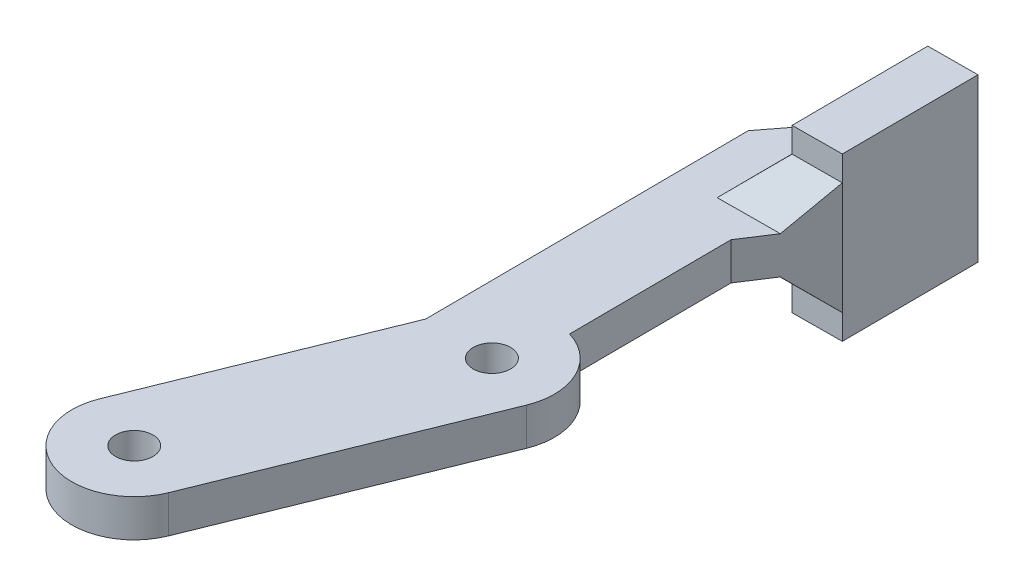
ISO-10303-21;
HEADER;
FILE_DESCRIPTION(('STEP AP214'),'2;1');
FILE_NAME('part.step','',(''),(''),'','','');
FILE_SCHEMA(('AUTOMOTIVE_DESIGN { 1 0 10303 214 1 1 1 1 }'));
ENDSEC;
DATA;
#1=APPLICATION_CONTEXT('core data for automotive mechanical design processes');
#2=APPLICATION_PROTOCOL_DEFINITION('international standard','automotive_design',2000,#1);
#3=PRODUCT_CONTEXT('',#1,'mechanical');
#4=PRODUCT('Part','Part','',(#3));
#5=PRODUCT_RELATED_PRODUCT_CATEGORY('part','',(#4));
#6=PRODUCT_DEFINITION_FORMATION('','',#4);
#7=PRODUCT_DEFINITION_CONTEXT('part definition',#1,'design');
#8=PRODUCT_DEFINITION('design','',#6,#7);
#9=PRODUCT_DEFINITION_SHAPE('','',#8);
#10=(LENGTH_UNIT() NAMED_UNIT(*) SI_UNIT(.MILLI.,.METRE.));
#11=(NAMED_UNIT(*) PLANE_ANGLE_UNIT() SI_UNIT($,.RADIAN.));
#12=(NAMED_UNIT(*) SI_UNIT($,.STERADIAN.) SOLID_ANGLE_UNIT());
#13=UNCERTAINTY_MEASURE_WITH_UNIT(LENGTH_MEASURE(1.E-05),#10,'distance_accuracy_value','');
#14=(GEOMETRIC_REPRESENTATION_CONTEXT(3) GLOBAL_UNCERTAINTY_ASSIGNED_CONTEXT((#13)) GLOBAL_UNIT_ASSIGNED_CONTEXT((#10,
#11,#12)) REPRESENTATION_CONTEXT('',''));
#15=CARTESIAN_POINT('',(0.,0.,0.));
#16=DIRECTION('',(0.,0.,1.));
#17=DIRECTION('',(1.,0.,0.));
#18=AXIS2_PLACEMENT_3D('',#15,#16,#17);
#19=CARTESIAN_POINT('',(-31.3872397273265,0.,12.6392763690197));
#20=DIRECTION('',(0.,1.,0.));
#21=DIRECTION('',(0.375044776060288,0.,-0.92700669682041));
#22=AXIS2_PLACEMENT_3D('',#19,#20,#21);
#23=CYLINDRICAL_SURFACE('',#22,1.5);
#24=CARTESIAN_POINT('',(-31.3872397273265,3.,12.6392763690197));
#25=DIRECTION('',(0.,-1.,0.));
#26=DIRECTION('',(0.375044776060288,0.,-0.92700669682041));
#27=AXIS2_PLACEMENT_3D('',#24,#25,#26);
#28=CIRCLE('',#27,1.5);
#29=CARTESIAN_POINT('',(-31.9498068914169,3.,14.0297864142503));
#30=VERTEX_POINT('',#29);
#31=EDGE_CURVE('E283',#30,#30,#28,.T.);
#32=ORIENTED_EDGE('',*,*,#31,.F.);
#33=DIRECTION('',(0.,-1.,0.));
#34=VECTOR('',#33,1.);
#35=CARTESIAN_POINT('',(-31.9498068914169,0.,14.0297864142503));
#36=LINE('',#35,#34);
#37=CARTESIAN_POINT('',(-31.9498068914169,0.,14.0297864142503));
#38=VERTEX_POINT('',#37);
#39=EDGE_CURVE('E296',#30,#38,#36,.T.);
#40=ORIENTED_EDGE('',*,*,#39,.T.);
#41=CARTESIAN_POINT('',(-31.3872397273265,0.,12.6392763690197));
#42=DIRECTION('',(0.,-1.,0.));
#43=DIRECTION('',(0.375044776060288,0.,-0.92700669682041));
#44=AXIS2_PLACEMENT_3D('',#41,#42,#43);
#45=CIRCLE('',#44,1.5);
#46=EDGE_CURVE('E300',#38,#38,#45,.T.);
#47=ORIENTED_EDGE('',*,*,#46,.T.);
#48=ORIENTED_EDGE('',*,*,#39,.F.);
#49=EDGE_LOOP('',(#32,#40,#47,#48));
#50=FACE_BOUND('',#49,.T.);
#51=ADVANCED_FACE('F45',(#50),#23,.F.);
#52=CARTESIAN_POINT('',(-23.1362546540001,0.,-7.75487096102932));
#53=DIRECTION('',(0.,1.,0.));
#54=DIRECTION('',(0.375044776060288,0.,-0.92700669682041));
#55=AXIS2_PLACEMENT_3D('',#52,#53,#54);
#56=CYLINDRICAL_SURFACE('',#55,1.5);
#57=CARTESIAN_POINT('',(-23.1362546540001,3.,-7.75487096102932));
#58=DIRECTION('',(0.,-1.,0.));
#59=DIRECTION('',(0.375044776060288,0.,-0.92700669682041));
#60=AXIS2_PLACEMENT_3D('',#57,#58,#59);
#61=CIRCLE('',#60,1.5);
#62=CARTESIAN_POINT('',(-23.6988218180906,3.,-6.3643609157987));
#63=VERTEX_POINT('',#62);
#64=EDGE_CURVE('E274',#63,#63,#61,.T.);
#65=ORIENTED_EDGE('',*,*,#64,.F.);
#66=DIRECTION('',(0.,-1.,0.));
#67=VECTOR('',#66,1.);
#68=CARTESIAN_POINT('',(-23.6988218180906,0.,-6.3643609157987));
#69=LINE('',#68,#67);
#70=CARTESIAN_POINT('',(-23.6988218180906,0.,-6.3643609157987));
#71=VERTEX_POINT('',#70);
#72=EDGE_CURVE('E303',#63,#71,#69,.T.);
#73=ORIENTED_EDGE('',*,*,#72,.T.);
#74=CARTESIAN_POINT('',(-23.1362546540001,0.,-7.75487096102932));
#75=DIRECTION('',(0.,-1.,0.));
#76=DIRECTION('',(0.375044776060288,0.,-0.92700669682041));
#77=AXIS2_PLACEMENT_3D('',#74,#75,#76);
#78=CIRCLE('',#77,1.5);
#79=EDGE_CURVE('E306',#71,#71,#78,.T.);
#80=ORIENTED_EDGE('',*,*,#79,.T.);
#81=ORIENTED_EDGE('',*,*,#72,.F.);
#82=EDGE_LOOP('',(#65,#73,#80,#81));
#83=FACE_BOUND('',#82,.T.);
#84=ADVANCED_FACE('F426',(#83),#56,.F.);
#85=CARTESIAN_POINT('',(-22.4694527490322,0.,-41.856975182389));
#86=DIRECTION('',(-0.793469040105591,0.,-0.60861061639928));
#87=DIRECTION('',(0.,-1.,0.));
#88=AXIS2_PLACEMENT_3D('',#85,#86,#87);
#89=PLANE('',#88);
#90=DIRECTION('',(0.60861061639928,0.,-0.793469040105591));
#91=VECTOR('',#90,1.);
#92=CARTESIAN_POINT('',(-28.6490392047294,0.,-33.8004109340342));
#93=LINE('',#92,#91);
#94=CARTESIAN_POINT('',(-28.6490392047294,0.,-33.8004109340342));
#95=VERTEX_POINT('',#94);
#96=CARTESIAN_POINT('',(-25.3076334762986,0.,-38.1567299408028));
#97=VERTEX_POINT('',#96);
#98=EDGE_CURVE('E280',#95,#97,#93,.T.);
#99=ORIENTED_EDGE('',*,*,#98,.F.);
#100=DIRECTION('',(0.,1.,0.));
#101=VECTOR('',#100,1.);
#102=CARTESIAN_POINT('',(-28.6490392047294,0.,-33.8004109340342));
#103=LINE('',#102,#101);
#104=CARTESIAN_POINT('',(-28.6490392047294,3.,-33.8004109340342));
#105=VERTEX_POINT('',#104);
#106=EDGE_CURVE('E234',#95,#105,#103,.T.);
#107=ORIENTED_EDGE('',*,*,#106,.T.);
#108=DIRECTION('',(-0.60861061639928,0.,0.793469040105591));
#109=VECTOR('',#108,1.);
#110=CARTESIAN_POINT('',(-28.6490392047294,3.,-33.8004109340342));
#111=LINE('',#110,#109);
#112=CARTESIAN_POINT('',(-25.3076334762987,3.,-38.1567299408027));
#113=VERTEX_POINT('',#112);
#114=EDGE_CURVE('E240',#113,#105,#111,.T.);
#115=ORIENTED_EDGE('',*,*,#114,.F.);
#116=DIRECTION('',(0.518862939394076,0.522667223898671,-0.676461545976854));
#117=VECTOR('',#116,1.);
#118=CARTESIAN_POINT('',(-34.2394605458331,-5.99731490599091,-26.5119638780906));
#119=LINE('',#118,#117);
#120=CARTESIAN_POINT('',(-22.4694527490322,5.85899016679708,-41.856975182389));
#121=VERTEX_POINT('',#120);
#122=EDGE_CURVE('E326',#113,#121,#119,.T.);
#123=ORIENTED_EDGE('',*,*,#122,.T.);
#124=DIRECTION('',(0.,1.,0.));
#125=VECTOR('',#124,1.);
#126=CARTESIAN_POINT('',(-22.4694527490322,0.,-41.856975182389));
#127=LINE('',#126,#125);
#128=CARTESIAN_POINT('',(-22.4694527490322,-2.85899016679709,-41.856975182389));
#129=VERTEX_POINT('',#128);
#130=EDGE_CURVE('E232',#129,#121,#127,.T.);
#131=ORIENTED_EDGE('',*,*,#130,.F.);
#132=DIRECTION('',(0.518862939394073,-0.52266722389868,-0.67646154597685));
#133=VECTOR('',#132,1.);
#134=CARTESIAN_POINT('',(-37.0646653622775,11.8432340230524,-22.8286358299069));
#135=LINE('',#134,#133);
#136=EDGE_CURVE('E337',#129,#97,#135,.F.);
#137=ORIENTED_EDGE('',*,*,#136,.T.);
#138=EDGE_LOOP('',(#99,#107,#115,#123,#131,#137));
#139=FACE_BOUND('',#138,.T.);
#140=ADVANCED_FACE('F407',(#139),#89,.T.);
#141=CARTESIAN_POINT('',(-18.3285086844811,0.,-41.8803138400729));
#142=DIRECTION('',(-0.00563598219370531,0.,-0.999984117726233));
#143=DIRECTION('',(0.,-1.,0.));
#144=AXIS2_PLACEMENT_3D('',#141,#142,#143);
#145=PLANE('',#144);
#146=DIRECTION('',(0.,1.,0.));
#147=VECTOR('',#146,1.);
#148=CARTESIAN_POINT('',(-22.328445155386,8.,-41.8577699112981));
#149=LINE('',#148,#147);
#150=CARTESIAN_POINT('',(-22.328445155386,-5.,-41.8577699112981));
#151=VERTEX_POINT('',#150);
#152=CARTESIAN_POINT('',(-22.328445155386,-3.00000000000001,-41.8577699112981));
#153=VERTEX_POINT('',#152);
#154=EDGE_CURVE('E211',#151,#153,#149,.T.);
#155=ORIENTED_EDGE('',*,*,#154,.T.);
#156=DIRECTION('',(0.707095550723062,-0.707106781186551,-0.00398524122781564));
#157=VECTOR('',#156,1.);
#158=CARTESIAN_POINT('',(-22.328445155386,-3.00000000000001,-41.8577699112981));
#159=LINE('',#158,#157);
#160=EDGE_CURVE('E334',#153,#129,#159,.F.);
#161=ORIENTED_EDGE('',*,*,#160,.T.);
#162=ORIENTED_EDGE('',*,*,#130,.T.);
#163=DIRECTION('',(0.70709555072307,0.707106781186544,-0.00398524122781568));
#164=VECTOR('',#163,1.);
#165=CARTESIAN_POINT('',(-25.3283975085647,3.,-41.8408619647169));
#166=LINE('',#165,#164);
#167=CARTESIAN_POINT('',(-22.328445155386,5.99999999999999,-41.8577699112981));
#168=VERTEX_POINT('',#167);
#169=EDGE_CURVE('E329',#121,#168,#166,.T.);
#170=ORIENTED_EDGE('',*,*,#169,.T.);
#171=CARTESIAN_POINT('',(-22.328445155386,8.,-41.8577699112981));
#172=VERTEX_POINT('',#171);
#173=EDGE_CURVE('E212',#168,#172,#149,.T.);
#174=ORIENTED_EDGE('',*,*,#173,.T.);
#175=DIRECTION('',(0.999984117726233,0.,-0.00563598219370531));
#176=VECTOR('',#175,1.);
#177=CARTESIAN_POINT('',(-22.328445155386,8.,-41.8577699112981));
#178=LINE('',#177,#176);
#179=CARTESIAN_POINT('',(-18.3285086844811,8.,-41.8803138400729));
#180=VERTEX_POINT('',#179);
#181=EDGE_CURVE('E228',#172,#180,#178,.T.);
#182=ORIENTED_EDGE('',*,*,#181,.T.);
#183=DIRECTION('',(0.,1.,0.));
#184=VECTOR('',#183,1.);
#185=CARTESIAN_POINT('',(-18.3285086844811,0.,-41.8803138400729));
#186=LINE('',#185,#184);
#187=CARTESIAN_POINT('',(-18.3285086844811,-5.,-41.8803138400729));
#188=VERTEX_POINT('',#187);
#189=EDGE_CURVE('E235',#188,#180,#186,.T.);
#190=ORIENTED_EDGE('',*,*,#189,.F.);
#191=DIRECTION('',(0.999984117726233,0.,-0.00563598219370531));
#192=VECTOR('',#191,1.);
#193=CARTESIAN_POINT('',(-22.328445155386,-5.,-41.8577699112981));
#194=LINE('',#193,#192);
#195=EDGE_CURVE('E205',#151,#188,#194,.T.);
#196=ORIENTED_EDGE('',*,*,#195,.F.);
#197=EDGE_LOOP('',(#155,#161,#162,#170,#174,#182,#190,#196));
#198=FACE_BOUND('',#197,.T.);
#199=ADVANCED_FACE('F363',(#198),#145,.T.);
#200=CARTESIAN_POINT('',(-18.2669129599048,0.,-30.9514740781325));
#201=DIRECTION('',(0.999984117726233,0.,-0.00563598219370531));
#202=DIRECTION('',(0.,-1.,0.));
#203=AXIS2_PLACEMENT_3D('',#200,#201,#202);
#204=PLANE('',#203);
#205=DIRECTION('',(0.,1.,0.));
#206=VECTOR('',#205,1.);
#207=CARTESIAN_POINT('',(-18.2669129599048,0.,-30.9514740781325));
#208=LINE('',#207,#206);
#209=CARTESIAN_POINT('',(-18.2669129599048,-3.,-30.9514740781325));
#210=VERTEX_POINT('',#209);
#211=CARTESIAN_POINT('',(-18.2669129599048,6.00000000000001,-30.9514740781325));
#212=VERTEX_POINT('',#211);
#213=EDGE_CURVE('E61',#210,#212,#208,.T.);
#214=ORIENTED_EDGE('',*,*,#213,.F.);
#215=DIRECTION('',(0.,-1.,0.));
#216=VECTOR('',#215,1.);
#217=CARTESIAN_POINT('',(-18.2669129599048,8.,-30.9514740781325));
#218=LINE('',#217,#216);
#219=CARTESIAN_POINT('',(-18.2669129599048,-5.,-30.9514740781325));
#220=VERTEX_POINT('',#219);
#221=EDGE_CURVE('E221',#210,#220,#218,.T.);
#222=ORIENTED_EDGE('',*,*,#221,.T.);
#223=DIRECTION('',(-0.00563598219370546,0.,-0.999984117726233));
#224=VECTOR('',#223,1.);
#225=CARTESIAN_POINT('',(-18.2669129599048,-5.,-30.9514740781325));
#226=LINE('',#225,#224);
#227=EDGE_CURVE('E204',#220,#188,#226,.T.);
#228=ORIENTED_EDGE('',*,*,#227,.T.);
#229=ORIENTED_EDGE('',*,*,#189,.T.);
#230=DIRECTION('',(0.00563598219370546,0.,0.999984117726233));
#231=VECTOR('',#230,1.);
#232=CARTESIAN_POINT('',(-18.2669129599048,8.,-30.9514740781325));
#233=LINE('',#232,#231);
#234=CARTESIAN_POINT('',(-18.2669129599048,8.,-30.9514740781325));
#235=VERTEX_POINT('',#234);
#236=EDGE_CURVE('E196',#180,#235,#233,.T.);
#237=ORIENTED_EDGE('',*,*,#236,.T.);
#238=EDGE_CURVE('E219',#235,#212,#218,.T.);
#239=ORIENTED_EDGE('',*,*,#238,.T.);
#240=EDGE_LOOP('',(#214,#222,#228,#229,#237,#239));
#241=FACE_BOUND('',#240,.T.);
#242=ADVANCED_FACE('F364',(#241),#204,.T.);
#243=CARTESIAN_POINT('',(-21.7766740850845,0.,-25.5449615221264));
#244=DIRECTION('',(0.838760494799222,0.,0.544500534769402));
#245=DIRECTION('',(-0.544500534769402,0.,0.838760494799222));
#246=AXIS2_PLACEMENT_3D('',#243,#244,#245);
#247=PLANE('',#246);
#248=DIRECTION('',(0.544500534769402,0.,-0.838760494799222));
#249=VECTOR('',#248,1.);
#250=CARTESIAN_POINT('',(-21.7766740850845,0.,-25.5449615221264));
#251=LINE('',#250,#249);
#252=CARTESIAN_POINT('',(-21.7766740850845,0.,-25.5449615221264));
#253=VERTEX_POINT('',#252);
#254=CARTESIAN_POINT('',(-20.2216142507366,0.,-27.9404095939129));
#255=VERTEX_POINT('',#254);
#256=EDGE_CURVE('E256',#253,#255,#251,.T.);
#257=ORIENTED_EDGE('',*,*,#256,.T.);
#258=DIRECTION('',(0.417814631992256,-0.641245750363926,-0.643610768192532));
#259=VECTOR('',#258,1.);
#260=CARTESIAN_POINT('',(-21.3437182836396,1.72216190499193,-26.2118960778471));
#261=LINE('',#260,#259);
#262=EDGE_CURVE('E54',#255,#210,#261,.T.);
#263=ORIENTED_EDGE('',*,*,#262,.T.);
#264=ORIENTED_EDGE('',*,*,#213,.T.);
#265=DIRECTION('',(0.417814631992252,0.641245750363935,-0.643610768192526));
#266=VECTOR('',#265,1.);
#267=CARTESIAN_POINT('',(-18.9712404243197,4.91902542697678,-29.8665126964076));
#268=LINE('',#267,#266);
#269=CARTESIAN_POINT('',(-20.2216142507365,3.,-27.9404095939129));
#270=VERTEX_POINT('',#269);
#271=EDGE_CURVE('E345',#212,#270,#268,.F.);
#272=ORIENTED_EDGE('',*,*,#271,.T.);
#273=DIRECTION('',(0.544500534769402,0.,-0.838760494799222));
#274=VECTOR('',#273,1.);
#275=CARTESIAN_POINT('',(-21.7766740850845,3.,-25.5449615221264));
#276=LINE('',#275,#274);
#277=CARTESIAN_POINT('',(-21.7766740850845,3.,-25.5449615221264));
#278=VERTEX_POINT('',#277);
#279=EDGE_CURVE('E236',#278,#270,#276,.T.);
#280=ORIENTED_EDGE('',*,*,#279,.F.);
#281=DIRECTION('',(0.,1.,0.));
#282=VECTOR('',#281,1.);
#283=CARTESIAN_POINT('',(-21.7766740850845,0.,-25.5449615221264));
#284=LINE('',#283,#282);
#285=EDGE_CURVE('E266',#253,#278,#284,.T.);
#286=ORIENTED_EDGE('',*,*,#285,.F.);
#287=EDGE_LOOP('',(#257,#263,#264,#272,#280,#286));
#288=FACE_BOUND('',#287,.T.);
#289=ADVANCED_FACE('F353',(#288),#247,.T.);
#290=CARTESIAN_POINT('',(-21.7034063165663,0.,-12.5451679916855));
#291=DIRECTION('',(0.999984117726233,0.,-0.00563598219370576));
#292=DIRECTION('',(0.,-1.,0.));
#293=AXIS2_PLACEMENT_3D('',#290,#291,#292);
#294=PLANE('',#293);
#295=DIRECTION('',(0.00563598219370531,0.,0.999984117726233));
#296=VECTOR('',#295,1.);
#297=CARTESIAN_POINT('',(-21.7766740850845,0.,-25.5449615221264));
#298=LINE('',#297,#296);
#299=CARTESIAN_POINT('',(-21.7034063165663,0.,-12.5451679916855));
#300=VERTEX_POINT('',#299);
#301=EDGE_CURVE('E227',#253,#300,#298,.T.);
#302=ORIENTED_EDGE('',*,*,#301,.F.);
#303=ORIENTED_EDGE('',*,*,#285,.T.);
#304=DIRECTION('',(-0.00563598219370531,0.,-0.999984117726233));
#305=VECTOR('',#304,1.);
#306=CARTESIAN_POINT('',(-21.7766740850845,3.,-25.5449615221264));
#307=LINE('',#306,#305);
#308=CARTESIAN_POINT('',(-21.7034063165663,3.,-12.5451679916855));
#309=VERTEX_POINT('',#308);
#310=EDGE_CURVE('E239',#309,#278,#307,.T.);
#311=ORIENTED_EDGE('',*,*,#310,.F.);
#312=DIRECTION('',(0.,1.,0.));
#313=VECTOR('',#312,1.);
#314=CARTESIAN_POINT('',(-21.7034063165663,0.,-12.5451679916855));
#315=LINE('',#314,#313);
#316=EDGE_CURVE('E264',#300,#309,#315,.T.);
#317=ORIENTED_EDGE('',*,*,#316,.F.);
#318=EDGE_LOOP('',(#302,#303,#311,#317));
#319=FACE_BOUND('',#318,.T.);
#320=ADVANCED_FACE('F386',(#319),#294,.T.);
#321=CARTESIAN_POINT('',(-23.1362546540001,0.,-7.75487096102932));
#322=DIRECTION('',(0.,1.,0.));
#323=DIRECTION('',(0.92700669682041,0.,0.375044776060288));
#324=AXIS2_PLACEMENT_3D('',#321,#322,#323);
#325=CYLINDRICAL_SURFACE('',#324,5.);
#326=CARTESIAN_POINT('',(-23.1362546540001,0.,-7.75487096102932));
#327=DIRECTION('',(0.,1.,0.));
#328=DIRECTION('',(0.92700669682041,0.,0.375044776060288));
#329=AXIS2_PLACEMENT_3D('',#326,#327,#328);
#330=CIRCLE('',#329,5.);
#331=CARTESIAN_POINT('',(-18.5012211698981,0.,-5.87964708072788));
#332=VERTEX_POINT('',#331);
#333=EDGE_CURVE('E269',#332,#300,#330,.T.);
#334=ORIENTED_EDGE('',*,*,#333,.T.);
#335=ORIENTED_EDGE('',*,*,#316,.T.);
#336=CARTESIAN_POINT('',(-23.1362546540001,3.,-7.75487096102932));
#337=DIRECTION('',(0.,1.,0.));
#338=DIRECTION('',(0.92700669682041,0.,0.375044776060288));
#339=AXIS2_PLACEMENT_3D('',#336,#337,#338);
#340=CIRCLE('',#339,5.);
#341=CARTESIAN_POINT('',(-18.5012211698981,3.,-5.87964708072788));
#342=VERTEX_POINT('',#341);
#343=EDGE_CURVE('E245',#342,#309,#340,.T.);
#344=ORIENTED_EDGE('',*,*,#343,.F.);
#345=DIRECTION('',(0.,1.,0.));
#346=VECTOR('',#345,1.);
#347=CARTESIAN_POINT('',(-18.5012211698981,0.,-5.87964708072788));
#348=LINE('',#347,#346);
#349=EDGE_CURVE('E246',#332,#342,#348,.T.);
#350=ORIENTED_EDGE('',*,*,#349,.F.);
#351=EDGE_LOOP('',(#334,#335,#344,#350));
#352=FACE_BOUND('',#351,.T.);
#353=ADVANCED_FACE('F388',(#352),#325,.T.);
#354=CARTESIAN_POINT('',(-26.7522062432244,0.,14.5145002493212));
#355=DIRECTION('',(0.92700669682041,0.,0.375044776060288));
#356=DIRECTION('',(0.,-1.,0.));
#357=AXIS2_PLACEMENT_3D('',#354,#355,#356);
#358=PLANE('',#357);
#359=DIRECTION('',(0.375044776060288,0.,-0.92700669682041));
#360=VECTOR('',#359,1.);
#361=CARTESIAN_POINT('',(-26.7522062432244,0.,14.5145002493212));
#362=LINE('',#361,#360);
#363=CARTESIAN_POINT('',(-26.7522062432244,0.,14.5145002493212));
#364=VERTEX_POINT('',#363);
#365=EDGE_CURVE('E249',#364,#332,#362,.T.);
#366=ORIENTED_EDGE('',*,*,#365,.T.);
#367=ORIENTED_EDGE('',*,*,#349,.T.);
#368=DIRECTION('',(0.375044776060288,0.,-0.92700669682041));
#369=VECTOR('',#368,1.);
#370=CARTESIAN_POINT('',(-26.7522062432244,3.,14.5145002493212));
#371=LINE('',#370,#369);
#372=CARTESIAN_POINT('',(-26.7522062432244,3.,14.5145002493212));
#373=VERTEX_POINT('',#372);
#374=EDGE_CURVE('E241',#373,#342,#371,.T.);
#375=ORIENTED_EDGE('',*,*,#374,.F.);
#376=DIRECTION('',(0.,1.,0.));
#377=VECTOR('',#376,1.);
#378=CARTESIAN_POINT('',(-26.7522062432244,0.,14.5145002493212));
#379=LINE('',#378,#377);
#380=EDGE_CURVE('E287',#364,#373,#379,.T.);
#381=ORIENTED_EDGE('',*,*,#380,.F.);
#382=EDGE_LOOP('',(#366,#367,#375,#381));
#383=FACE_BOUND('',#382,.T.);
#384=ADVANCED_FACE('F395',(#383),#358,.T.);
#385=CARTESIAN_POINT('',(-31.3872397273265,0.,12.6392763690197));
#386=DIRECTION('',(0.,1.,0.));
#387=DIRECTION('',(-0.92700669682041,0.,-0.375044776060288));
#388=AXIS2_PLACEMENT_3D('',#385,#386,#387);
#389=CYLINDRICAL_SURFACE('',#388,5.);
#390=CARTESIAN_POINT('',(-31.3872397273265,0.,12.6392763690197));
#391=DIRECTION('',(0.,1.,0.));
#392=DIRECTION('',(-0.92700669682041,0.,-0.375044776060288));
#393=AXIS2_PLACEMENT_3D('',#390,#391,#392);
#394=CIRCLE('',#393,5.);
#395=CARTESIAN_POINT('',(-36.0222732114285,0.,10.7640524887183));
#396=VERTEX_POINT('',#395);
#397=EDGE_CURVE('E250',#396,#364,#394,.T.);
#398=ORIENTED_EDGE('',*,*,#397,.T.);
#399=ORIENTED_EDGE('',*,*,#380,.T.);
#400=CARTESIAN_POINT('',(-31.3872397273265,3.,12.6392763690197));
#401=DIRECTION('',(0.,1.,0.));
#402=DIRECTION('',(-0.92700669682041,0.,-0.375044776060288));
#403=AXIS2_PLACEMENT_3D('',#400,#401,#402);
#404=CIRCLE('',#403,5.);
#405=CARTESIAN_POINT('',(-36.0222732114285,3.,10.7640524887183));
#406=VERTEX_POINT('',#405);
#407=EDGE_CURVE('E244',#406,#373,#404,.T.);
#408=ORIENTED_EDGE('',*,*,#407,.F.);
#409=DIRECTION('',(0.,1.,0.));
#410=VECTOR('',#409,1.);
#411=CARTESIAN_POINT('',(-36.0222732114285,0.,10.7640524887183));
#412=LINE('',#411,#410);
#413=EDGE_CURVE('E254',#396,#406,#412,.T.);
#414=ORIENTED_EDGE('',*,*,#413,.F.);
#415=EDGE_LOOP('',(#398,#399,#408,#414));
#416=FACE_BOUND('',#415,.T.);
#417=ADVANCED_FACE('F397',(#416),#389,.T.);
#418=CARTESIAN_POINT('',(-28.5026254514198,0.,-7.82243178253096));
#419=DIRECTION('',(-0.92700669682041,0.,-0.375044776060288));
#420=DIRECTION('',(0.375044776060288,0.,-0.92700669682041));
#421=AXIS2_PLACEMENT_3D('',#418,#419,#420);
#422=PLANE('',#421);
#423=DIRECTION('',(-0.375044776060288,0.,0.92700669682041));
#424=VECTOR('',#423,1.);
#425=CARTESIAN_POINT('',(-27.7712881381022,0.,-9.63009484133076));
#426=LINE('',#425,#424);
#427=CARTESIAN_POINT('',(-28.5026254514198,0.,-7.82243178253096));
#428=VERTEX_POINT('',#427);
#429=EDGE_CURVE('E290',#428,#396,#426,.T.);
#430=ORIENTED_EDGE('',*,*,#429,.T.);
#431=ORIENTED_EDGE('',*,*,#413,.T.);
#432=DIRECTION('',(-0.375044776060288,0.,0.92700669682041));
#433=VECTOR('',#432,1.);
#434=CARTESIAN_POINT('',(-27.7712881381022,3.,-9.63009484133076));
#435=LINE('',#434,#433);
#436=CARTESIAN_POINT('',(-28.5026254514198,3.,-7.82243178253096));
#437=VERTEX_POINT('',#436);
#438=EDGE_CURVE('E272',#437,#406,#435,.T.);
#439=ORIENTED_EDGE('',*,*,#438,.F.);
#440=DIRECTION('',(0.,1.,0.));
#441=VECTOR('',#440,1.);
#442=CARTESIAN_POINT('',(-28.5026254514198,0.,-7.82243178253096));
#443=LINE('',#442,#441);
#444=EDGE_CURVE('E255',#428,#437,#443,.T.);
#445=ORIENTED_EDGE('',*,*,#444,.F.);
#446=EDGE_LOOP('',(#430,#431,#439,#445));
#447=FACE_BOUND('',#446,.T.);
#448=ADVANCED_FACE('F400',(#447),#422,.T.);
#449=CARTESIAN_POINT('',(-28.6490392047294,0.,-33.8004109340342));
#450=DIRECTION('',(-0.999984117726233,0.,0.00563598219370531));
#451=DIRECTION('',(0.,1.,0.));
#452=AXIS2_PLACEMENT_3D('',#449,#450,#451);
#453=PLANE('',#452);
#454=DIRECTION('',(0.00563598219370531,0.,0.999984117726233));
#455=VECTOR('',#454,1.);
#456=CARTESIAN_POINT('',(-28.6942488460058,0.,-41.8218917852229));
#457=LINE('',#456,#455);
#458=EDGE_CURVE('E251',#95,#428,#457,.T.);
#459=ORIENTED_EDGE('',*,*,#458,.T.);
#460=ORIENTED_EDGE('',*,*,#444,.T.);
#461=DIRECTION('',(0.00563598219370531,0.,0.999984117726233));
#462=VECTOR('',#461,1.);
#463=CARTESIAN_POINT('',(-28.6942488460058,3.,-41.8218917852229));
#464=LINE('',#463,#462);
#465=EDGE_CURVE('E261',#105,#437,#464,.T.);
#466=ORIENTED_EDGE('',*,*,#465,.F.);
#467=ORIENTED_EDGE('',*,*,#106,.F.);
#468=EDGE_LOOP('',(#459,#460,#466,#467));
#469=FACE_BOUND('',#468,.T.);
#470=ADVANCED_FACE('F403',(#469),#453,.T.);
#471=CARTESIAN_POINT('',(-26.5078331007745,3.,-12.5912005631586));
#472=DIRECTION('',(0.,1.,0.));
#473=DIRECTION('',(0.375044776060288,0.,-0.92700669682041));
#474=AXIS2_PLACEMENT_3D('',#471,#472,#473);
#475=PLANE('',#474);
#476=ORIENTED_EDGE('',*,*,#279,.T.);
#477=DIRECTION('',(-0.999984117726233,0.,0.00563598219370531));
#478=VECTOR('',#477,1.);
#479=CARTESIAN_POINT('',(-25.2498938374073,3.,-27.9120698495979));
#480=LINE('',#479,#478);
#481=CARTESIAN_POINT('',(-25.2498938374073,3.,-27.9120698495979));
#482=VERTEX_POINT('',#481);
#483=EDGE_CURVE('E342',#270,#482,#480,.T.);
#484=ORIENTED_EDGE('',*,*,#483,.T.);
#485=DIRECTION('',(-0.00563598219370546,0.,-0.999984117726233));
#486=VECTOR('',#485,1.);
#487=CARTESIAN_POINT('',(-25.163587019876,3.,-12.5987768304628));
#488=LINE('',#487,#486);
#489=EDGE_CURVE('E299',#482,#113,#488,.T.);
#490=ORIENTED_EDGE('',*,*,#489,.T.);
#491=ORIENTED_EDGE('',*,*,#114,.T.);
#492=ORIENTED_EDGE('',*,*,#465,.T.);
#493=ORIENTED_EDGE('',*,*,#438,.T.);
#494=ORIENTED_EDGE('',*,*,#407,.T.);
#495=ORIENTED_EDGE('',*,*,#374,.T.);
#496=ORIENTED_EDGE('',*,*,#343,.T.);
#497=ORIENTED_EDGE('',*,*,#310,.T.);
#498=EDGE_LOOP('',(#476,#484,#490,#491,#492,#493,#494,#495,#496,#497));
#499=FACE_BOUND('',#498,.T.);
#500=ORIENTED_EDGE('',*,*,#64,.T.);
#501=EDGE_LOOP('',(#500));
#502=FACE_BOUND('',#501,.T.);
#503=ORIENTED_EDGE('',*,*,#31,.T.);
#504=EDGE_LOOP('',(#503));
#505=FACE_BOUND('',#504,.T.);
#506=ADVANCED_FACE('F381',(#499,#502,#505),#475,.T.);
#507=CARTESIAN_POINT('',(-26.5078331007745,0.,-12.5912005631586));
#508=DIRECTION('',(0.,1.,0.));
#509=DIRECTION('',(0.375044776060288,0.,-0.92700669682041));
#510=AXIS2_PLACEMENT_3D('',#507,#508,#509);
#511=PLANE('',#510);
#512=DIRECTION('',(0.00563598219370546,0.,0.999984117726233));
#513=VECTOR('',#512,1.);
#514=CARTESIAN_POINT('',(-25.2668017839884,0.,-30.9120222027766));
#515=LINE('',#514,#513);
#516=CARTESIAN_POINT('',(-25.2498938374073,0.,-27.9120698495978));
#517=VERTEX_POINT('',#516);
#518=EDGE_CURVE('E69',#97,#517,#515,.T.);
#519=ORIENTED_EDGE('',*,*,#518,.T.);
#520=DIRECTION('',(0.999984117726233,0.,-0.00563598219370531));
#521=VECTOR('',#520,1.);
#522=CARTESIAN_POINT('',(-26.5941399183059,0.,-27.9044935822936));
#523=LINE('',#522,#521);
#524=EDGE_CURVE('E349',#517,#255,#523,.T.);
#525=ORIENTED_EDGE('',*,*,#524,.T.);
#526=ORIENTED_EDGE('',*,*,#256,.F.);
#527=ORIENTED_EDGE('',*,*,#301,.T.);
#528=ORIENTED_EDGE('',*,*,#333,.F.);
#529=ORIENTED_EDGE('',*,*,#365,.F.);
#530=ORIENTED_EDGE('',*,*,#397,.F.);
#531=ORIENTED_EDGE('',*,*,#429,.F.);
#532=ORIENTED_EDGE('',*,*,#458,.F.);
#533=ORIENTED_EDGE('',*,*,#98,.T.);
#534=EDGE_LOOP('',(#519,#525,#526,#527,#528,#529,#530,#531,#532,#533));
#535=FACE_BOUND('',#534,.T.);
#536=ORIENTED_EDGE('',*,*,#79,.F.);
#537=EDGE_LOOP('',(#536));
#538=FACE_BOUND('',#537,.T.);
#539=ORIENTED_EDGE('',*,*,#46,.F.);
#540=EDGE_LOOP('',(#539));
#541=FACE_BOUND('',#540,.T.);
#542=ADVANCED_FACE('F391',(#535,#538,#541),#511,.F.);
#543=CARTESIAN_POINT('',(-22.2668494308097,-5.,-30.9289301493577));
#544=DIRECTION('',(0.,-1.,0.));
#545=DIRECTION('',(0.,0.,-1.));
#546=AXIS2_PLACEMENT_3D('',#543,#544,#545);
#547=PLANE('',#546);
#548=ORIENTED_EDGE('',*,*,#227,.F.);
#549=DIRECTION('',(0.999984117726233,0.,-0.00563598219370531));
#550=VECTOR('',#549,1.);
#551=CARTESIAN_POINT('',(-22.2668494308097,-5.,-30.9289301493577));
#552=LINE('',#551,#550);
#553=CARTESIAN_POINT('',(-22.2668494308097,-5.,-30.9289301493577));
#554=VERTEX_POINT('',#553);
#555=EDGE_CURVE('E187',#554,#220,#552,.T.);
#556=ORIENTED_EDGE('',*,*,#555,.F.);
#557=DIRECTION('',(-0.00563598219370546,0.,-0.999984117726233));
#558=VECTOR('',#557,1.);
#559=CARTESIAN_POINT('',(-22.2668494308097,-5.,-30.9289301493577));
#560=LINE('',#559,#558);
#561=EDGE_CURVE('E202',#554,#151,#560,.T.);
#562=ORIENTED_EDGE('',*,*,#561,.T.);
#563=ORIENTED_EDGE('',*,*,#195,.T.);
#564=EDGE_LOOP('',(#548,#556,#562,#563));
#565=FACE_BOUND('',#564,.T.);
#566=ADVANCED_FACE('F200',(#565),#547,.T.);
#567=CARTESIAN_POINT('',(-22.0918300089541,0.,0.124511138076814));
#568=DIRECTION('',(0.999984117726233,0.,-0.00563598219370546));
#569=DIRECTION('',(-0.00563598219370546,0.,-0.999984117726233));
#570=AXIS2_PLACEMENT_3D('',#567,#568,#569);
#571=PLANE('',#570);
#572=DIRECTION('',(0.,-1.,0.));
#573=VECTOR('',#572,1.);
#574=CARTESIAN_POINT('',(-22.2668494308097,8.,-30.9289301493577));
#575=LINE('',#574,#573);
#576=CARTESIAN_POINT('',(-22.2668494308097,-3.00000000000001,-30.9289301493577));
#577=VERTEX_POINT('',#576);
#578=EDGE_CURVE('E184',#577,#554,#575,.T.);
#579=ORIENTED_EDGE('',*,*,#578,.F.);
#580=DIRECTION('',(-0.00563598219370546,0.,-0.999984117726233));
#581=VECTOR('',#580,1.);
#582=CARTESIAN_POINT('',(-22.328445155386,-3.00000000000001,-41.8577699112981));
#583=LINE('',#582,#581);
#584=EDGE_CURVE('E331',#577,#153,#583,.T.);
#585=ORIENTED_EDGE('',*,*,#584,.T.);
#586=ORIENTED_EDGE('',*,*,#154,.F.);
#587=ORIENTED_EDGE('',*,*,#561,.F.);
#588=EDGE_LOOP('',(#579,#585,#586,#587));
#589=FACE_BOUND('',#588,.T.);
#590=ADVANCED_FACE('F209',(#589),#571,.F.);
#591=CARTESIAN_POINT('',(-22.2668494308097,8.,-30.9289301493577));
#592=DIRECTION('',(0.00563598219370531,0.,0.999984117726233));
#593=DIRECTION('',(0.999984117726233,0.,-0.00563598219370531));
#594=AXIS2_PLACEMENT_3D('',#591,#592,#593);
#595=PLANE('',#594);
#596=ORIENTED_EDGE('',*,*,#221,.F.);
#597=DIRECTION('',(-0.999984117726233,0.,0.00563598219370531));
#598=VECTOR('',#597,1.);
#599=CARTESIAN_POINT('',(-22.2668494308097,-3.,-30.9289301493577));
#600=LINE('',#599,#598);
#601=EDGE_CURVE('E190',#210,#577,#600,.T.);
#602=ORIENTED_EDGE('',*,*,#601,.T.);
#603=ORIENTED_EDGE('',*,*,#578,.T.);
#604=ORIENTED_EDGE('',*,*,#555,.T.);
#605=EDGE_LOOP('',(#596,#602,#603,#604));
#606=FACE_BOUND('',#605,.T.);
#607=ADVANCED_FACE('F186',(#606),#595,.T.);
#608=CARTESIAN_POINT('',(-22.2668494308097,8.,-30.9289301493577));
#609=VERTEX_POINT('',#608);
#610=CARTESIAN_POINT('',(-22.2668494308097,5.99999999999999,-30.9289301493577));
#611=VERTEX_POINT('',#610);
#612=EDGE_CURVE('E195',#609,#611,#575,.T.);
#613=ORIENTED_EDGE('',*,*,#612,.T.);
#614=DIRECTION('',(0.999984117726233,0.,-0.00563598219370531));
#615=VECTOR('',#614,1.);
#616=CARTESIAN_POINT('',(-18.2669129599048,6.00000000000001,-30.9514740781325));
#617=LINE('',#616,#615);
#618=EDGE_CURVE('E339',#611,#212,#617,.T.);
#619=ORIENTED_EDGE('',*,*,#618,.T.);
#620=ORIENTED_EDGE('',*,*,#238,.F.);
#621=DIRECTION('',(0.999984117726233,0.,-0.00563598219370531));
#622=VECTOR('',#621,1.);
#623=CARTESIAN_POINT('',(-22.2668494308097,8.,-30.9289301493577));
#624=LINE('',#623,#622);
#625=EDGE_CURVE('E225',#609,#235,#624,.T.);
#626=ORIENTED_EDGE('',*,*,#625,.F.);
#627=EDGE_LOOP('',(#613,#619,#620,#626));
#628=FACE_BOUND('',#627,.T.);
#629=ADVANCED_FACE('F374',(#628),#595,.T.);
#630=CARTESIAN_POINT('',(-22.2668494308097,8.,-30.9289301493577));
#631=DIRECTION('',(0.,1.,0.));
#632=DIRECTION('',(0.,0.,1.));
#633=AXIS2_PLACEMENT_3D('',#630,#631,#632);
#634=PLANE('',#633);
#635=ORIENTED_EDGE('',*,*,#236,.F.);
#636=ORIENTED_EDGE('',*,*,#181,.F.);
#637=DIRECTION('',(0.00563598219370546,0.,0.999984117726233));
#638=VECTOR('',#637,1.);
#639=CARTESIAN_POINT('',(-22.2668494308097,8.,-30.9289301493577));
#640=LINE('',#639,#638);
#641=EDGE_CURVE('E206',#172,#609,#640,.T.);
#642=ORIENTED_EDGE('',*,*,#641,.T.);
#643=ORIENTED_EDGE('',*,*,#625,.T.);
#644=EDGE_LOOP('',(#635,#636,#642,#643));
#645=FACE_BOUND('',#644,.T.);
#646=ADVANCED_FACE('F370',(#645),#634,.T.);
#647=ORIENTED_EDGE('',*,*,#173,.F.);
#648=DIRECTION('',(0.00563598219370546,0.,0.999984117726233));
#649=VECTOR('',#648,1.);
#650=CARTESIAN_POINT('',(-22.0918300089541,5.99999999999999,0.124511138076814));
#651=LINE('',#650,#649);
#652=EDGE_CURVE('E323',#168,#611,#651,.T.);
#653=ORIENTED_EDGE('',*,*,#652,.T.);
#654=ORIENTED_EDGE('',*,*,#612,.F.);
#655=ORIENTED_EDGE('',*,*,#641,.F.);
#656=EDGE_LOOP('',(#647,#653,#654,#655));
#657=FACE_BOUND('',#656,.T.);
#658=ADVANCED_FACE('F413',(#657),#571,.F.);
#659=CARTESIAN_POINT('',(-25.163587019876,3.,-12.5987768304628));
#660=DIRECTION('',(0.707095550723062,-0.707106781186552,-0.00398524122781574));
#661=DIRECTION('',(-0.00563598219370546,0.,-0.999984117726233));
#662=AXIS2_PLACEMENT_3D('',#659,#660,#661);
#663=PLANE('',#662);
#664=ORIENTED_EDGE('',*,*,#489,.F.);
#665=DIRECTION('',(-0.574087163717914,-0.577350269189626,0.580595035391268));
#666=VECTOR('',#665,1.);
#667=CARTESIAN_POINT('',(-30.3255559046086,-2.10451207763656,-22.7788699040425));
#668=LINE('',#667,#666);
#669=EDGE_CURVE('E347',#482,#611,#668,.F.);
#670=ORIENTED_EDGE('',*,*,#669,.T.);
#671=ORIENTED_EDGE('',*,*,#652,.F.);
#672=ORIENTED_EDGE('',*,*,#169,.F.);
#673=ORIENTED_EDGE('',*,*,#122,.F.);
#674=EDGE_LOOP('',(#664,#670,#671,#672,#673));
#675=FACE_BOUND('',#674,.T.);
#676=ADVANCED_FACE('F414',(#675),#663,.F.);
#677=CARTESIAN_POINT('',(-22.0918300089541,-3.00000000000001,0.124511138076814));
#678=DIRECTION('',(-0.70709555072307,-0.707106781186544,0.00398524122781578));
#679=DIRECTION('',(0.00563598219370546,0.,0.999984117726233));
#680=AXIS2_PLACEMENT_3D('',#677,#678,#679);
#681=PLANE('',#680);
#682=ORIENTED_EDGE('',*,*,#584,.F.);
#683=DIRECTION('',(0.5740871637179,-0.577350269189626,-0.580595035391281));
#684=VECTOR('',#683,1.);
#685=CARTESIAN_POINT('',(-32.559656719336,7.35131149817467,-20.5194432462607));
#686=LINE('',#685,#684);
#687=EDGE_CURVE('E11',#577,#517,#686,.F.);
#688=ORIENTED_EDGE('',*,*,#687,.T.);
#689=ORIENTED_EDGE('',*,*,#518,.F.);
#690=ORIENTED_EDGE('',*,*,#136,.F.);
#691=ORIENTED_EDGE('',*,*,#160,.F.);
#692=EDGE_LOOP('',(#682,#688,#689,#690,#691));
#693=FACE_BOUND('',#692,.T.);
#694=ADVANCED_FACE('F360',(#693),#681,.T.);
#695=CARTESIAN_POINT('',(-22.2668494308097,6.00000000000002,-30.9289301493577));
#696=DIRECTION('',(0.00398524122781568,0.707106781186544,0.70709555072307));
#697=DIRECTION('',(-0.999984117726233,0.,0.00563598219370531));
#698=AXIS2_PLACEMENT_3D('',#695,#696,#697);
#699=PLANE('',#698);
#700=ORIENTED_EDGE('',*,*,#669,.F.);
#701=ORIENTED_EDGE('',*,*,#483,.F.);
#702=ORIENTED_EDGE('',*,*,#271,.F.);
#703=ORIENTED_EDGE('',*,*,#618,.F.);
#704=EDGE_LOOP('',(#700,#701,#702,#703));
#705=FACE_BOUND('',#704,.T.);
#706=ADVANCED_FACE('F378',(#705),#699,.T.);
#707=CARTESIAN_POINT('',(-26.5941399183059,0.,-27.9044935822936));
#708=DIRECTION('',(-0.00398524122781563,0.707106781186552,-0.707095550723062));
#709=DIRECTION('',(0.999984117726233,0.,-0.00563598219370531));
#710=AXIS2_PLACEMENT_3D('',#707,#708,#709);
#711=PLANE('',#710);
#712=ORIENTED_EDGE('',*,*,#687,.F.);
#713=ORIENTED_EDGE('',*,*,#601,.F.);
#714=ORIENTED_EDGE('',*,*,#262,.F.);
#715=ORIENTED_EDGE('',*,*,#524,.F.);
#716=EDGE_LOOP('',(#712,#713,#714,#715));
#717=FACE_BOUND('',#716,.T.);
#718=ADVANCED_FACE('F48',(#717),#711,.F.);
#719=CLOSED_SHELL('',(#51,#84,#140,#199,#242,#289,#320,#353,#384,#417,#448,#470,#506,#542,#566,
#590,#607,#629,#646,#658,#676,#694,#706,#718));
#720=MANIFOLD_SOLID_BREP('B2',#719);
#721=ADVANCED_BREP_SHAPE_REPRESENTATION('',(#18,#720),#14);
#722=SHAPE_DEFINITION_REPRESENTATION(#9,#721);
ENDSEC;
END-ISO-10303-21;
